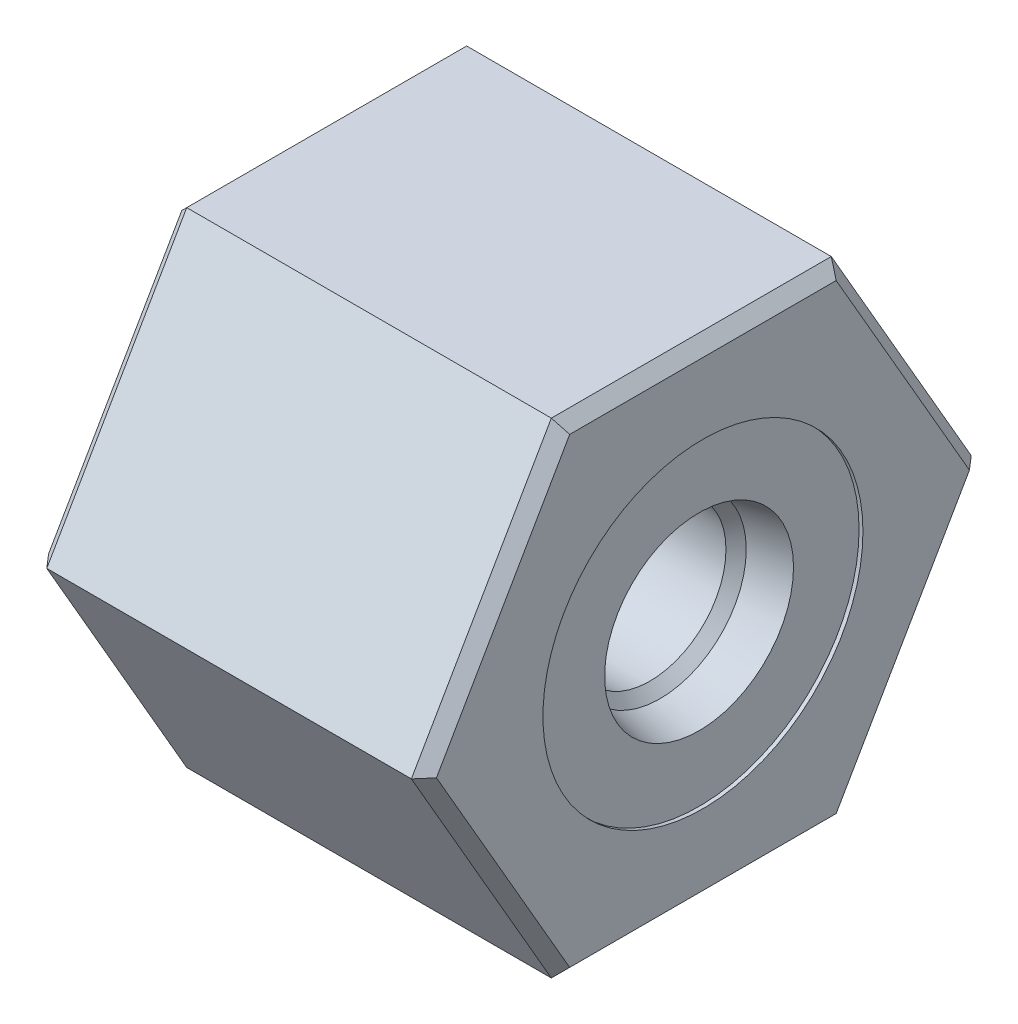
ISO-10303-21;
HEADER;
FILE_DESCRIPTION(('STEP AP214'),'2;1');
FILE_NAME('part.step','',(''),(''),'','','');
FILE_SCHEMA(('AUTOMOTIVE_DESIGN { 1 0 10303 214 1 1 1 1 }'));
ENDSEC;
DATA;
#1=APPLICATION_CONTEXT('core data for automotive mechanical design processes');
#2=APPLICATION_PROTOCOL_DEFINITION('international standard','automotive_design',2000,#1);
#3=PRODUCT_CONTEXT('',#1,'mechanical');
#4=PRODUCT('Part','Part','',(#3));
#5=PRODUCT_RELATED_PRODUCT_CATEGORY('part','',(#4));
#6=PRODUCT_DEFINITION_FORMATION('','',#4);
#7=PRODUCT_DEFINITION_CONTEXT('part definition',#1,'design');
#8=PRODUCT_DEFINITION('design','',#6,#7);
#9=PRODUCT_DEFINITION_SHAPE('','',#8);
#10=(LENGTH_UNIT() NAMED_UNIT(*) SI_UNIT(.MILLI.,.METRE.));
#11=(NAMED_UNIT(*) PLANE_ANGLE_UNIT() SI_UNIT($,.RADIAN.));
#12=(NAMED_UNIT(*) SI_UNIT($,.STERADIAN.) SOLID_ANGLE_UNIT());
#13=UNCERTAINTY_MEASURE_WITH_UNIT(LENGTH_MEASURE(1.E-05),#10,'distance_accuracy_value','');
#14=(GEOMETRIC_REPRESENTATION_CONTEXT(3) GLOBAL_UNCERTAINTY_ASSIGNED_CONTEXT((#13)) GLOBAL_UNIT_ASSIGNED_CONTEXT((#10,
#11,#12)) REPRESENTATION_CONTEXT('',''));
#15=CARTESIAN_POINT('',(0.,0.,0.));
#16=DIRECTION('',(0.,0.,1.));
#17=DIRECTION('',(1.,0.,0.));
#18=AXIS2_PLACEMENT_3D('',#15,#16,#17);
#19=CARTESIAN_POINT('',(25.4,-15.875,-9.16543552338531));
#20=DIRECTION('',(0.,-1.,0.));
#21=DIRECTION('',(0.,0.,-1.));
#22=AXIS2_PLACEMENT_3D('',#19,#20,#21);
#23=PLANE('',#22);
#24=DIRECTION('',(-1.,0.,0.));
#25=VECTOR('',#24,1.);
#26=CARTESIAN_POINT('',(25.4,-15.875,-9.16543552338531));
#27=LINE('',#26,#25);
#28=CARTESIAN_POINT('',(24.638,-15.875,-9.16543552338531));
#29=VERTEX_POINT('',#28);
#30=CARTESIAN_POINT('',(0.762000000000006,-15.875,-9.16543552338531));
#31=VERTEX_POINT('',#30);
#32=EDGE_CURVE('E261',#29,#31,#27,.T.);
#33=ORIENTED_EDGE('',*,*,#32,.F.);
#34=DIRECTION('',(0.,0.,1.));
#35=VECTOR('',#34,1.);
#36=CARTESIAN_POINT('',(24.638,-15.875,9.1654355233853));
#37=LINE('',#36,#35);
#38=CARTESIAN_POINT('',(24.638,-15.875,9.1654355233853));
#39=VERTEX_POINT('',#38);
#40=EDGE_CURVE('E42',#29,#39,#37,.T.);
#41=ORIENTED_EDGE('',*,*,#40,.T.);
#42=DIRECTION('',(-1.,0.,0.));
#43=VECTOR('',#42,1.);
#44=CARTESIAN_POINT('',(25.4,-15.875,9.1654355233853));
#45=LINE('',#44,#43);
#46=CARTESIAN_POINT('',(0.762000000000006,-15.875,9.1654355233853));
#47=VERTEX_POINT('',#46);
#48=EDGE_CURVE('E237',#39,#47,#45,.T.);
#49=ORIENTED_EDGE('',*,*,#48,.T.);
#50=DIRECTION('',(0.,0.,-1.));
#51=VECTOR('',#50,1.);
#52=CARTESIAN_POINT('',(0.761999999999999,-15.875,-9.16543552338531));
#53=LINE('',#52,#51);
#54=EDGE_CURVE('E150',#47,#31,#53,.T.);
#55=ORIENTED_EDGE('',*,*,#54,.T.);
#56=EDGE_LOOP('',(#33,#41,#49,#55));
#57=FACE_BOUND('',#56,.T.);
#58=ADVANCED_FACE('F33',(#57),#23,.T.);
#59=CARTESIAN_POINT('',(25.4,0.,-18.3308710467706));
#60=DIRECTION('',(0.,-0.5,-0.866025403784439));
#61=DIRECTION('',(0.,0.866025403784439,-0.5));
#62=AXIS2_PLACEMENT_3D('',#59,#60,#61);
#63=PLANE('',#62);
#64=DIRECTION('',(-1.,0.,0.));
#65=VECTOR('',#64,1.);
#66=CARTESIAN_POINT('',(25.4,0.,-18.3308710467706));
#67=LINE('',#66,#65);
#68=CARTESIAN_POINT('',(24.638,0.,-18.3308710467706));
#69=VERTEX_POINT('',#68);
#70=CARTESIAN_POINT('',(0.762000000000006,0.,-18.3308710467706));
#71=VERTEX_POINT('',#70);
#72=EDGE_CURVE('E259',#69,#71,#67,.T.);
#73=ORIENTED_EDGE('',*,*,#72,.F.);
#74=DIRECTION('',(0.,-0.866025403784439,0.5));
#75=VECTOR('',#74,1.);
#76=CARTESIAN_POINT('',(24.638,-15.875,-9.16543552338531));
#77=LINE('',#76,#75);
#78=EDGE_CURVE('E179',#69,#29,#77,.T.);
#79=ORIENTED_EDGE('',*,*,#78,.T.);
#80=ORIENTED_EDGE('',*,*,#32,.T.);
#81=DIRECTION('',(0.,0.866025403784439,-0.5));
#82=VECTOR('',#81,1.);
#83=CARTESIAN_POINT('',(0.761999999999999,0.,-18.3308710467706));
#84=LINE('',#83,#82);
#85=EDGE_CURVE('E218',#31,#71,#84,.T.);
#86=ORIENTED_EDGE('',*,*,#85,.T.);
#87=EDGE_LOOP('',(#73,#79,#80,#86));
#88=FACE_BOUND('',#87,.T.);
#89=ADVANCED_FACE('F338',(#88),#63,.T.);
#90=CARTESIAN_POINT('',(25.4,15.875,-9.16543552338532));
#91=DIRECTION('',(0.,0.5,-0.866025403784439));
#92=DIRECTION('',(0.,0.866025403784439,0.5));
#93=AXIS2_PLACEMENT_3D('',#90,#91,#92);
#94=PLANE('',#93);
#95=DIRECTION('',(-1.,0.,0.));
#96=VECTOR('',#95,1.);
#97=CARTESIAN_POINT('',(25.4,15.875,-9.16543552338532));
#98=LINE('',#97,#96);
#99=CARTESIAN_POINT('',(24.638,15.875,-9.16543552338532));
#100=VERTEX_POINT('',#99);
#101=CARTESIAN_POINT('',(0.762000000000002,15.875,-9.16543552338532));
#102=VERTEX_POINT('',#101);
#103=EDGE_CURVE('E257',#100,#102,#98,.T.);
#104=ORIENTED_EDGE('',*,*,#103,.F.);
#105=DIRECTION('',(0.,-0.866025403784439,-0.5));
#106=VECTOR('',#105,1.);
#107=CARTESIAN_POINT('',(24.638,0.,-18.3308710467706));
#108=LINE('',#107,#106);
#109=EDGE_CURVE('E160',#100,#69,#108,.T.);
#110=ORIENTED_EDGE('',*,*,#109,.T.);
#111=ORIENTED_EDGE('',*,*,#72,.T.);
#112=DIRECTION('',(0.,0.866025403784439,0.5));
#113=VECTOR('',#112,1.);
#114=CARTESIAN_POINT('',(0.761999999999999,15.875,-9.16543552338532));
#115=LINE('',#114,#113);
#116=EDGE_CURVE('E222',#71,#102,#115,.T.);
#117=ORIENTED_EDGE('',*,*,#116,.T.);
#118=EDGE_LOOP('',(#104,#110,#111,#117));
#119=FACE_BOUND('',#118,.T.);
#120=ADVANCED_FACE('F256',(#119),#94,.T.);
#121=CARTESIAN_POINT('',(25.4,15.875,9.16543552338532));
#122=DIRECTION('',(0.,1.,0.));
#123=DIRECTION('',(0.,0.,1.));
#124=AXIS2_PLACEMENT_3D('',#121,#122,#123);
#125=PLANE('',#124);
#126=DIRECTION('',(-1.,0.,0.));
#127=VECTOR('',#126,1.);
#128=CARTESIAN_POINT('',(25.4,15.875,9.16543552338532));
#129=LINE('',#128,#127);
#130=CARTESIAN_POINT('',(24.638,15.875,9.16543552338532));
#131=VERTEX_POINT('',#130);
#132=CARTESIAN_POINT('',(0.762000000000002,15.875,9.16543552338532));
#133=VERTEX_POINT('',#132);
#134=EDGE_CURVE('E265',#131,#133,#129,.T.);
#135=ORIENTED_EDGE('',*,*,#134,.F.);
#136=DIRECTION('',(0.,0.,-1.));
#137=VECTOR('',#136,1.);
#138=CARTESIAN_POINT('',(24.638,15.875,-9.16543552338532));
#139=LINE('',#138,#137);
#140=EDGE_CURVE('E177',#131,#100,#139,.T.);
#141=ORIENTED_EDGE('',*,*,#140,.T.);
#142=ORIENTED_EDGE('',*,*,#103,.T.);
#143=DIRECTION('',(0.,0.,1.));
#144=VECTOR('',#143,1.);
#145=CARTESIAN_POINT('',(0.761999999999999,15.875,9.16543552338532));
#146=LINE('',#145,#144);
#147=EDGE_CURVE('E221',#102,#133,#146,.T.);
#148=ORIENTED_EDGE('',*,*,#147,.T.);
#149=EDGE_LOOP('',(#135,#141,#142,#148));
#150=FACE_BOUND('',#149,.T.);
#151=ADVANCED_FACE('F391',(#150),#125,.T.);
#152=CARTESIAN_POINT('',(25.4,0.,18.3308710467706));
#153=DIRECTION('',(0.,0.5,0.866025403784439));
#154=DIRECTION('',(0.,-0.866025403784439,0.5));
#155=AXIS2_PLACEMENT_3D('',#152,#153,#154);
#156=PLANE('',#155);
#157=DIRECTION('',(-1.,0.,0.));
#158=VECTOR('',#157,1.);
#159=CARTESIAN_POINT('',(25.4,0.,18.3308710467706));
#160=LINE('',#159,#158);
#161=CARTESIAN_POINT('',(24.638,0.,18.3308710467706));
#162=VERTEX_POINT('',#161);
#163=CARTESIAN_POINT('',(0.762000000000002,0.,18.3308710467706));
#164=VERTEX_POINT('',#163);
#165=EDGE_CURVE('E238',#162,#164,#160,.T.);
#166=ORIENTED_EDGE('',*,*,#165,.F.);
#167=DIRECTION('',(0.,0.866025403784439,-0.5));
#168=VECTOR('',#167,1.);
#169=CARTESIAN_POINT('',(24.638,15.875,9.16543552338532));
#170=LINE('',#169,#168);
#171=EDGE_CURVE('E181',#162,#131,#170,.T.);
#172=ORIENTED_EDGE('',*,*,#171,.T.);
#173=ORIENTED_EDGE('',*,*,#134,.T.);
#174=DIRECTION('',(0.,-0.866025403784439,0.5));
#175=VECTOR('',#174,1.);
#176=CARTESIAN_POINT('',(0.761999999999999,0.,18.3308710467706));
#177=LINE('',#176,#175);
#178=EDGE_CURVE('E231',#133,#164,#177,.T.);
#179=ORIENTED_EDGE('',*,*,#178,.T.);
#180=EDGE_LOOP('',(#166,#172,#173,#179));
#181=FACE_BOUND('',#180,.T.);
#182=ADVANCED_FACE('F334',(#181),#156,.T.);
#183=CARTESIAN_POINT('',(25.4,-15.875,9.1654355233853));
#184=DIRECTION('',(0.,-0.5,0.866025403784439));
#185=DIRECTION('',(0.,-0.866025403784439,-0.5));
#186=AXIS2_PLACEMENT_3D('',#183,#184,#185);
#187=PLANE('',#186);
#188=ORIENTED_EDGE('',*,*,#48,.F.);
#189=DIRECTION('',(0.,0.866025403784439,0.5));
#190=VECTOR('',#189,1.);
#191=CARTESIAN_POINT('',(24.638,0.,18.3308710467706));
#192=LINE('',#191,#190);
#193=EDGE_CURVE('E11',#39,#162,#192,.T.);
#194=ORIENTED_EDGE('',*,*,#193,.T.);
#195=ORIENTED_EDGE('',*,*,#165,.T.);
#196=DIRECTION('',(0.,-0.866025403784439,-0.5));
#197=VECTOR('',#196,1.);
#198=CARTESIAN_POINT('',(0.761999999999999,-15.875,9.1654355233853));
#199=LINE('',#198,#197);
#200=EDGE_CURVE('E164',#164,#47,#199,.T.);
#201=ORIENTED_EDGE('',*,*,#200,.T.);
#202=EDGE_LOOP('',(#188,#194,#195,#201));
#203=FACE_BOUND('',#202,.T.);
#204=ADVANCED_FACE('F236',(#203),#187,.T.);
#205=CARTESIAN_POINT('',(25.4,-15.875,27.4963065701559));
#206=DIRECTION('',(-1.,0.,0.));
#207=DIRECTION('',(0.,0.,1.));
#208=AXIS2_PLACEMENT_3D('',#205,#206,#207);
#209=PLANE('',#208);
#210=DIRECTION('',(0.,0.866025403784439,-0.5));
#211=VECTOR('',#210,1.);
#212=CARTESIAN_POINT('',(25.4,0.380999999999999,-17.6709596890869));
#213=LINE('',#212,#211);
#214=CARTESIAN_POINT('',(25.4,-15.113,-8.72549461826282));
#215=VERTEX_POINT('',#214);
#216=CARTESIAN_POINT('',(25.4,0.,-17.4509892365256));
#217=VERTEX_POINT('',#216);
#218=EDGE_CURVE('E170',#215,#217,#213,.T.);
#219=ORIENTED_EDGE('',*,*,#218,.T.);
#220=DIRECTION('',(0.,0.866025403784439,0.5));
#221=VECTOR('',#220,1.);
#222=CARTESIAN_POINT('',(25.4,15.494,-8.50552416570158));
#223=LINE('',#222,#221);
#224=CARTESIAN_POINT('',(25.4,15.113,-8.72549461826283));
#225=VERTEX_POINT('',#224);
#226=EDGE_CURVE('E174',#217,#225,#223,.T.);
#227=ORIENTED_EDGE('',*,*,#226,.T.);
#228=DIRECTION('',(0.,0.,1.));
#229=VECTOR('',#228,1.);
#230=CARTESIAN_POINT('',(25.4,15.113,9.16543552338532));
#231=LINE('',#230,#229);
#232=CARTESIAN_POINT('',(25.4,15.113,8.72549461826283));
#233=VERTEX_POINT('',#232);
#234=EDGE_CURVE('E172',#225,#233,#231,.T.);
#235=ORIENTED_EDGE('',*,*,#234,.T.);
#236=DIRECTION('',(0.,-0.866025403784439,0.5));
#237=VECTOR('',#236,1.);
#238=CARTESIAN_POINT('',(25.4,-0.380999999999989,17.6709596890869));
#239=LINE('',#238,#237);
#240=CARTESIAN_POINT('',(25.4,0.,17.4509892365256));
#241=VERTEX_POINT('',#240);
#242=EDGE_CURVE('E168',#233,#241,#239,.T.);
#243=ORIENTED_EDGE('',*,*,#242,.T.);
#244=DIRECTION('',(0.,-0.866025403784439,-0.5));
#245=VECTOR('',#244,1.);
#246=CARTESIAN_POINT('',(25.4,-15.494,8.50552416570156));
#247=LINE('',#246,#245);
#248=CARTESIAN_POINT('',(25.4,-15.113,8.72549461826281));
#249=VERTEX_POINT('',#248);
#250=EDGE_CURVE('E163',#241,#249,#247,.T.);
#251=ORIENTED_EDGE('',*,*,#250,.T.);
#252=DIRECTION('',(0.,0.,-1.));
#253=VECTOR('',#252,1.);
#254=CARTESIAN_POINT('',(25.4,-15.113,-9.16543552338531));
#255=LINE('',#254,#253);
#256=EDGE_CURVE('E166',#249,#215,#255,.T.);
#257=ORIENTED_EDGE('',*,*,#256,.T.);
#258=EDGE_LOOP('',(#219,#227,#235,#243,#251,#257));
#259=FACE_BOUND('',#258,.T.);
#260=CARTESIAN_POINT('',(25.4,0.,0.));
#261=DIRECTION('',(1.,0.,0.));
#262=DIRECTION('',(0.,0.,-1.));
#263=AXIS2_PLACEMENT_3D('',#260,#261,#262);
#264=CIRCLE('',#263,10.4774999999901);
#265=CARTESIAN_POINT('',(25.4,0.,-10.4774999999901));
#266=VERTEX_POINT('',#265);
#267=EDGE_CURVE('E272',#266,#266,#264,.T.);
#268=ORIENTED_EDGE('',*,*,#267,.F.);
#269=EDGE_LOOP('',(#268));
#270=FACE_BOUND('',#269,.T.);
#271=ADVANCED_FACE('F324',(#259,#270),#209,.F.);
#272=CARTESIAN_POINT('',(0.,-15.875,27.4963065701559));
#273=DIRECTION('',(-1.,0.,0.));
#274=DIRECTION('',(0.,0.,1.));
#275=AXIS2_PLACEMENT_3D('',#272,#273,#274);
#276=PLANE('',#275);
#277=DIRECTION('',(0.,0.,-1.));
#278=VECTOR('',#277,1.);
#279=CARTESIAN_POINT('',(0.,15.113,27.4963065701559));
#280=LINE('',#279,#278);
#281=CARTESIAN_POINT('',(0.,15.113,8.72549461826283));
#282=VERTEX_POINT('',#281);
#283=CARTESIAN_POINT('',(0.,15.113,-8.72549461826282));
#284=VERTEX_POINT('',#283);
#285=EDGE_CURVE('E134',#282,#284,#280,.T.);
#286=ORIENTED_EDGE('',*,*,#285,.T.);
#287=DIRECTION('',(0.,-0.866025403784439,-0.5));
#288=VECTOR('',#287,1.);
#289=CARTESIAN_POINT('',(0.,7.55649999999998,-13.0882419273942));
#290=LINE('',#289,#288);
#291=CARTESIAN_POINT('',(0.,0.,-17.4509892365256));
#292=VERTEX_POINT('',#291);
#293=EDGE_CURVE('E227',#284,#292,#290,.T.);
#294=ORIENTED_EDGE('',*,*,#293,.T.);
#295=DIRECTION('',(0.,-0.866025403784439,0.5));
#296=VECTOR('',#295,1.);
#297=CARTESIAN_POINT('',(0.,-31.369,0.659911357683743));
#298=LINE('',#297,#296);
#299=CARTESIAN_POINT('',(0.,-15.113,-8.72549461826282));
#300=VERTEX_POINT('',#299);
#301=EDGE_CURVE('E129',#292,#300,#298,.T.);
#302=ORIENTED_EDGE('',*,*,#301,.T.);
#303=DIRECTION('',(0.,0.,1.));
#304=VECTOR('',#303,1.);
#305=CARTESIAN_POINT('',(0.,-15.113,27.4963065701559));
#306=LINE('',#305,#304);
#307=CARTESIAN_POINT('',(0.,-15.113,8.7254946182628));
#308=VERTEX_POINT('',#307);
#309=EDGE_CURVE('E121',#300,#308,#306,.T.);
#310=ORIENTED_EDGE('',*,*,#309,.T.);
#311=DIRECTION('',(0.,0.866025403784439,0.5));
#312=VECTOR('',#311,1.);
#313=CARTESIAN_POINT('',(0.,-7.5565,13.0882419273942));
#314=LINE('',#313,#312);
#315=CARTESIAN_POINT('',(0.,0.,17.4509892365256));
#316=VERTEX_POINT('',#315);
#317=EDGE_CURVE('E125',#308,#316,#314,.T.);
#318=ORIENTED_EDGE('',*,*,#317,.T.);
#319=DIRECTION('',(0.,0.866025403784439,-0.5));
#320=VECTOR('',#319,1.);
#321=CARTESIAN_POINT('',(0.,-16.256,26.8363952124722));
#322=LINE('',#321,#320);
#323=EDGE_CURVE('E135',#316,#282,#322,.T.);
#324=ORIENTED_EDGE('',*,*,#323,.T.);
#325=EDGE_LOOP('',(#286,#294,#302,#310,#318,#324));
#326=FACE_BOUND('',#325,.T.);
#327=CARTESIAN_POINT('',(0.,0.,0.));
#328=DIRECTION('',(-1.,0.,0.));
#329=DIRECTION('',(0.,0.,1.));
#330=AXIS2_PLACEMENT_3D('',#327,#328,#329);
#331=CIRCLE('',#330,12.1411999999999);
#332=CARTESIAN_POINT('',(0.,0.,12.1411999999999));
#333=VERTEX_POINT('',#332);
#334=EDGE_CURVE('E263',#333,#333,#331,.F.);
#335=ORIENTED_EDGE('',*,*,#334,.T.);
#336=EDGE_LOOP('',(#335));
#337=FACE_BOUND('',#336,.T.);
#338=ADVANCED_FACE('F123',(#326,#337),#276,.T.);
#339=CARTESIAN_POINT('',(0.,0.,0.));
#340=DIRECTION('',(1.,0.,0.));
#341=DIRECTION('',(0.,0.,-1.));
#342=AXIS2_PLACEMENT_3D('',#339,#340,#341);
#343=CYLINDRICAL_SURFACE('',#342,11.8872);
#344=CARTESIAN_POINT('',(0.253999999999938,0.,0.));
#345=DIRECTION('',(-1.,0.,0.));
#346=DIRECTION('',(0.,0.,1.));
#347=AXIS2_PLACEMENT_3D('',#344,#345,#346);
#348=CIRCLE('',#347,11.8872);
#349=CARTESIAN_POINT('',(0.253999999999938,0.,11.8872));
#350=VERTEX_POINT('',#349);
#351=EDGE_CURVE('E275',#350,#350,#348,.T.);
#352=ORIENTED_EDGE('',*,*,#351,.T.);
#353=EDGE_LOOP('',(#352));
#354=FACE_BOUND('',#353,.T.);
#355=CARTESIAN_POINT('',(9.78518859409031,0.,0.));
#356=DIRECTION('',(1.,0.,0.));
#357=DIRECTION('',(0.,0.,-1.));
#358=AXIS2_PLACEMENT_3D('',#355,#356,#357);
#359=CIRCLE('',#358,11.8872);
#360=CARTESIAN_POINT('',(9.78518859409031,0.,-11.8872));
#361=VERTEX_POINT('',#360);
#362=EDGE_CURVE('E153',#361,#361,#359,.T.);
#363=ORIENTED_EDGE('',*,*,#362,.T.);
#364=EDGE_LOOP('',(#363));
#365=FACE_BOUND('',#364,.T.);
#366=ADVANCED_FACE('F332',(#354,#365),#343,.F.);
#367=CARTESIAN_POINT('',(0.,0.,0.));
#368=DIRECTION('',(1.,0.,0.));
#369=DIRECTION('',(0.,0.,-1.));
#370=AXIS2_PLACEMENT_3D('',#367,#368,#369);
#371=CYLINDRICAL_SURFACE('',#370,10.4774999999901);
#372=CARTESIAN_POINT('',(25.1460000000165,0.,0.));
#373=DIRECTION('',(1.,0.,0.));
#374=DIRECTION('',(0.,0.,-1.));
#375=AXIS2_PLACEMENT_3D('',#372,#373,#374);
#376=CIRCLE('',#375,10.4774999999901);
#377=CARTESIAN_POINT('',(25.1460000000165,0.,-10.4774999999901));
#378=VERTEX_POINT('',#377);
#379=EDGE_CURVE('E317',#378,#378,#376,.T.);
#380=ORIENTED_EDGE('',*,*,#379,.F.);
#381=EDGE_LOOP('',(#380));
#382=FACE_BOUND('',#381,.T.);
#383=ORIENTED_EDGE('',*,*,#267,.T.);
#384=EDGE_LOOP('',(#383));
#385=FACE_BOUND('',#384,.T.);
#386=ADVANCED_FACE('F322',(#382,#385),#371,.F.);
#387=CARTESIAN_POINT('',(25.1460000000165,10.4774999999901,0.));
#388=DIRECTION('',(-1.,0.,0.));
#389=DIRECTION('',(0.,0.,1.));
#390=AXIS2_PLACEMENT_3D('',#387,#388,#389);
#391=PLANE('',#390);
#392=CARTESIAN_POINT('',(25.1460000000165,0.,0.));
#393=DIRECTION('',(1.,0.,0.));
#394=DIRECTION('',(0.,0.,-1.));
#395=AXIS2_PLACEMENT_3D('',#392,#393,#394);
#396=CIRCLE('',#395,6.18489999999385);
#397=CARTESIAN_POINT('',(25.1460000000165,0.,-6.18489999999385));
#398=VERTEX_POINT('',#397);
#399=EDGE_CURVE('E314',#398,#398,#396,.T.);
#400=ORIENTED_EDGE('',*,*,#399,.F.);
#401=EDGE_LOOP('',(#400));
#402=FACE_BOUND('',#401,.T.);
#403=ORIENTED_EDGE('',*,*,#379,.T.);
#404=EDGE_LOOP('',(#403));
#405=FACE_BOUND('',#404,.T.);
#406=ADVANCED_FACE('F544',(#402,#405),#391,.F.);
#407=CARTESIAN_POINT('',(25.1460000000165,0.,0.));
#408=DIRECTION('',(1.,0.,0.));
#409=DIRECTION('',(0.,0.,-1.));
#410=AXIS2_PLACEMENT_3D('',#407,#408,#409);
#411=CONICAL_SURFACE('',#410,6.18489999999385,0.209439510237865);
#412=CARTESIAN_POINT('',(22.5932999999927,0.,0.));
#413=DIRECTION('',(1.,0.,0.));
#414=DIRECTION('',(0.,0.,-1.));
#415=AXIS2_PLACEMENT_3D('',#412,#413,#414);
#416=CIRCLE('',#415,5.6423068650176);
#417=CARTESIAN_POINT('',(22.5932999999927,0.,-5.6423068650176));
#418=VERTEX_POINT('',#417);
#419=EDGE_CURVE('E306',#418,#418,#416,.T.);
#420=ORIENTED_EDGE('',*,*,#419,.F.);
#421=EDGE_LOOP('',(#420));
#422=FACE_BOUND('',#421,.T.);
#423=ORIENTED_EDGE('',*,*,#399,.T.);
#424=EDGE_LOOP('',(#423));
#425=FACE_BOUND('',#424,.T.);
#426=ADVANCED_FACE('F535',(#422,#425),#411,.F.);
#427=CARTESIAN_POINT('',(22.5932999999927,0.,0.));
#428=DIRECTION('',(1.,0.,0.));
#429=DIRECTION('',(0.,0.,-1.));
#430=AXIS2_PLACEMENT_3D('',#427,#428,#429);
#431=CONICAL_SURFACE('',#430,5.6423068650176,0.78539816339745);
#432=CARTESIAN_POINT('',(21.9293931349751,0.,0.));
#433=DIRECTION('',(1.,0.,0.));
#434=DIRECTION('',(0.,0.,-1.));
#435=AXIS2_PLACEMENT_3D('',#432,#433,#434);
#436=CIRCLE('',#435,4.9784);
#437=CARTESIAN_POINT('',(21.9293931349751,0.,-4.9784));
#438=VERTEX_POINT('',#437);
#439=EDGE_CURVE('E302',#438,#438,#436,.T.);
#440=ORIENTED_EDGE('',*,*,#439,.F.);
#441=EDGE_LOOP('',(#440));
#442=FACE_BOUND('',#441,.T.);
#443=ORIENTED_EDGE('',*,*,#419,.T.);
#444=EDGE_LOOP('',(#443));
#445=FACE_BOUND('',#444,.T.);
#446=ADVANCED_FACE('F528',(#442,#445),#431,.F.);
#447=CARTESIAN_POINT('',(0.,0.,0.));
#448=DIRECTION('',(1.,0.,0.));
#449=DIRECTION('',(0.,0.,-1.));
#450=AXIS2_PLACEMENT_3D('',#447,#448,#449);
#451=CYLINDRICAL_SURFACE('',#450,4.9784);
#452=CARTESIAN_POINT('',(14.224,0.,0.));
#453=DIRECTION('',(1.,0.,0.));
#454=DIRECTION('',(0.,0.,-1.));
#455=AXIS2_PLACEMENT_3D('',#452,#453,#454);
#456=CIRCLE('',#455,4.9784);
#457=CARTESIAN_POINT('',(14.224,0.,-4.9784));
#458=VERTEX_POINT('',#457);
#459=EDGE_CURVE('E146',#458,#458,#456,.F.);
#460=ORIENTED_EDGE('',*,*,#459,.T.);
#461=EDGE_LOOP('',(#460));
#462=FACE_BOUND('',#461,.T.);
#463=ORIENTED_EDGE('',*,*,#439,.T.);
#464=EDGE_LOOP('',(#463));
#465=FACE_BOUND('',#464,.T.);
#466=ADVANCED_FACE('F283',(#462,#465),#451,.F.);
#467=CARTESIAN_POINT('',(13.462,4.9784,0.));
#468=DIRECTION('',(1.,0.,0.));
#469=DIRECTION('',(0.,0.,-1.));
#470=AXIS2_PLACEMENT_3D('',#467,#468,#469);
#471=PLANE('',#470);
#472=CARTESIAN_POINT('',(13.462,0.,0.));
#473=DIRECTION('',(1.,0.,0.));
#474=DIRECTION('',(0.,0.,-1.));
#475=AXIS2_PLACEMENT_3D('',#472,#473,#474);
#476=CIRCLE('',#475,5.74039999999999);
#477=CARTESIAN_POINT('',(13.462,0.,-5.74039999999999));
#478=VERTEX_POINT('',#477);
#479=EDGE_CURVE('E278',#478,#478,#476,.T.);
#480=ORIENTED_EDGE('',*,*,#479,.T.);
#481=EDGE_LOOP('',(#480));
#482=FACE_BOUND('',#481,.T.);
#483=CARTESIAN_POINT('',(13.462,0.,0.));
#484=DIRECTION('',(1.,0.,0.));
#485=DIRECTION('',(0.,0.,-1.));
#486=AXIS2_PLACEMENT_3D('',#483,#484,#485);
#487=CIRCLE('',#486,11.7221);
#488=CARTESIAN_POINT('',(13.462,0.,-11.7221));
#489=VERTEX_POINT('',#488);
#490=EDGE_CURVE('E300',#489,#489,#487,.T.);
#491=ORIENTED_EDGE('',*,*,#490,.F.);
#492=EDGE_LOOP('',(#491));
#493=FACE_BOUND('',#492,.T.);
#494=ADVANCED_FACE('F293',(#482,#493),#471,.F.);
#495=CARTESIAN_POINT('',(0.,0.,0.));
#496=DIRECTION('',(1.,0.,0.));
#497=DIRECTION('',(0.,0.,-1.));
#498=AXIS2_PLACEMENT_3D('',#495,#496,#497);
#499=CYLINDRICAL_SURFACE('',#498,11.7221);
#500=CARTESIAN_POINT('',(10.16,0.,0.));
#501=DIRECTION('',(1.,0.,0.));
#502=DIRECTION('',(0.,0.,-1.));
#503=AXIS2_PLACEMENT_3D('',#500,#501,#502);
#504=CIRCLE('',#503,11.7221);
#505=CARTESIAN_POINT('',(10.16,0.,-11.7221));
#506=VERTEX_POINT('',#505);
#507=EDGE_CURVE('E303',#506,#506,#504,.T.);
#508=ORIENTED_EDGE('',*,*,#507,.F.);
#509=EDGE_LOOP('',(#508));
#510=FACE_BOUND('',#509,.T.);
#511=ORIENTED_EDGE('',*,*,#490,.T.);
#512=EDGE_LOOP('',(#511));
#513=FACE_BOUND('',#512,.T.);
#514=ADVANCED_FACE('F296',(#510,#513),#499,.F.);
#515=CARTESIAN_POINT('',(9.78518859409031,0.,0.));
#516=DIRECTION('',(1.,0.,0.));
#517=DIRECTION('',(0.,0.,-1.));
#518=AXIS2_PLACEMENT_3D('',#515,#516,#517);
#519=TOROIDAL_SURFACE('',#518,11.3792,0.508);
#520=ORIENTED_EDGE('',*,*,#362,.F.);
#521=EDGE_LOOP('',(#520));
#522=FACE_BOUND('',#521,.T.);
#523=ORIENTED_EDGE('',*,*,#507,.T.);
#524=EDGE_LOOP('',(#523));
#525=FACE_BOUND('',#524,.T.);
#526=ADVANCED_FACE('F347',(#522,#525),#519,.F.);
#527=CARTESIAN_POINT('',(0.,0.,0.));
#528=DIRECTION('',(-1.,0.,0.));
#529=DIRECTION('',(0.,0.,1.));
#530=AXIS2_PLACEMENT_3D('',#527,#528,#529);
#531=CONICAL_SURFACE('',#530,12.1411999999999,0.785398163397458);
#532=ORIENTED_EDGE('',*,*,#351,.F.);
#533=EDGE_LOOP('',(#532));
#534=FACE_BOUND('',#533,.T.);
#535=ORIENTED_EDGE('',*,*,#334,.F.);
#536=EDGE_LOOP('',(#535));
#537=FACE_BOUND('',#536,.T.);
#538=ADVANCED_FACE('F289',(#534,#537),#531,.F.);
#539=CARTESIAN_POINT('',(13.462,0.,0.));
#540=DIRECTION('',(-1.,0.,0.));
#541=DIRECTION('',(0.,0.,1.));
#542=AXIS2_PLACEMENT_3D('',#539,#540,#541);
#543=CONICAL_SURFACE('',#542,5.74039999999999,0.785398163397452);
#544=ORIENTED_EDGE('',*,*,#459,.F.);
#545=EDGE_LOOP('',(#544));
#546=FACE_BOUND('',#545,.T.);
#547=ORIENTED_EDGE('',*,*,#479,.F.);
#548=EDGE_LOOP('',(#547));
#549=FACE_BOUND('',#548,.T.);
#550=ADVANCED_FACE('F286',(#546,#549),#543,.F.);
#551=CARTESIAN_POINT('',(0.,-7.5565,13.0882419273942));
#552=DIRECTION('',(0.707106781186549,0.353553390593273,-0.612372435695793));
#553=DIRECTION('',(-0.654653670707976,0.,-0.755928946018456));
#554=AXIS2_PLACEMENT_3D('',#551,#552,#553);
#555=PLANE('',#554);
#556=DIRECTION('',(0.654653670707975,-0.654653670707978,0.377964473009228));
#557=VECTOR('',#556,1.);
#558=CARTESIAN_POINT('',(-2.159,-12.954,7.4789953870824));
#559=LINE('',#558,#557);
#560=EDGE_CURVE('E141',#47,#308,#559,.F.);
#561=ORIENTED_EDGE('',*,*,#560,.F.);
#562=ORIENTED_EDGE('',*,*,#200,.F.);
#563=DIRECTION('',(-0.654653670707976,0.,-0.755928946018455));
#564=VECTOR('',#563,1.);
#565=CARTESIAN_POINT('',(-2.15899999999999,0.,14.9579907741648));
#566=LINE('',#565,#564);
#567=EDGE_CURVE('E144',#316,#164,#566,.F.);
#568=ORIENTED_EDGE('',*,*,#567,.F.);
#569=ORIENTED_EDGE('',*,*,#317,.F.);
#570=EDGE_LOOP('',(#561,#562,#568,#569));
#571=FACE_BOUND('',#570,.T.);
#572=ADVANCED_FACE('F139',(#571),#555,.F.);
#573=CARTESIAN_POINT('',(0.,-16.256,26.8363952124722));
#574=DIRECTION('',(0.707106781186548,-0.353553390593273,-0.612372435695794));
#575=DIRECTION('',(-0.654653670707977,0.,-0.755928946018455));
#576=AXIS2_PLACEMENT_3D('',#573,#574,#575);
#577=PLANE('',#576);
#578=ORIENTED_EDGE('',*,*,#567,.T.);
#579=ORIENTED_EDGE('',*,*,#178,.F.);
#580=DIRECTION('',(-0.654653670707976,-0.654653670707979,-0.377964473009226));
#581=VECTOR('',#580,1.);
#582=CARTESIAN_POINT('',(-8.96257142857147,6.15042857142848,3.55095159134585));
#583=LINE('',#582,#581);
#584=EDGE_CURVE('E151',#282,#133,#583,.F.);
#585=ORIENTED_EDGE('',*,*,#584,.F.);
#586=ORIENTED_EDGE('',*,*,#323,.F.);
#587=EDGE_LOOP('',(#578,#579,#585,#586));
#588=FACE_BOUND('',#587,.T.);
#589=ADVANCED_FACE('F240',(#588),#577,.F.);
#590=CARTESIAN_POINT('',(0.,-15.113,27.4963065701559));
#591=DIRECTION('',(0.707106781186549,0.707106781186546,0.));
#592=DIRECTION('',(-0.707106781186546,0.707106781186549,0.));
#593=AXIS2_PLACEMENT_3D('',#590,#591,#592);
#594=PLANE('',#593);
#595=ORIENTED_EDGE('',*,*,#560,.T.);
#596=ORIENTED_EDGE('',*,*,#309,.F.);
#597=DIRECTION('',(0.654653670707976,-0.654653670707979,-0.377964473009225));
#598=VECTOR('',#597,1.);
#599=CARTESIAN_POINT('',(-8.96257142857136,-6.15042857142859,-3.55095159134592));
#600=LINE('',#599,#598);
#601=EDGE_CURVE('E156',#31,#300,#600,.F.);
#602=ORIENTED_EDGE('',*,*,#601,.F.);
#603=ORIENTED_EDGE('',*,*,#54,.F.);
#604=EDGE_LOOP('',(#595,#596,#602,#603));
#605=FACE_BOUND('',#604,.T.);
#606=ADVANCED_FACE('F148',(#605),#594,.F.);
#607=CARTESIAN_POINT('',(0.,15.113,27.4963065701559));
#608=DIRECTION('',(0.707106781186549,-0.707106781186546,0.));
#609=DIRECTION('',(0.707106781186546,0.707106781186549,0.));
#610=AXIS2_PLACEMENT_3D('',#607,#608,#609);
#611=PLANE('',#610);
#612=ORIENTED_EDGE('',*,*,#584,.T.);
#613=ORIENTED_EDGE('',*,*,#147,.F.);
#614=DIRECTION('',(-0.654653670707976,-0.654653670707979,0.377964473009227));
#615=VECTOR('',#614,1.);
#616=CARTESIAN_POINT('',(-8.96257142857141,6.15042857142854,-3.55095159134585));
#617=LINE('',#616,#615);
#618=EDGE_CURVE('E204',#284,#102,#617,.F.);
#619=ORIENTED_EDGE('',*,*,#618,.F.);
#620=ORIENTED_EDGE('',*,*,#285,.F.);
#621=EDGE_LOOP('',(#612,#613,#619,#620));
#622=FACE_BOUND('',#621,.T.);
#623=ADVANCED_FACE('F251',(#622),#611,.F.);
#624=CARTESIAN_POINT('',(0.,-31.369,0.659911357683743));
#625=DIRECTION('',(0.707106781186547,0.353553390593274,0.612372435695794));
#626=DIRECTION('',(0.654653670707977,0.,-0.755928946018454));
#627=AXIS2_PLACEMENT_3D('',#624,#625,#626);
#628=PLANE('',#627);
#629=ORIENTED_EDGE('',*,*,#601,.T.);
#630=ORIENTED_EDGE('',*,*,#301,.F.);
#631=DIRECTION('',(0.654653670707976,0.,-0.755928946018455));
#632=VECTOR('',#631,1.);
#633=CARTESIAN_POINT('',(-8.96257142857147,0.,-7.10190318269163));
#634=LINE('',#633,#632);
#635=EDGE_CURVE('E199',#71,#292,#634,.F.);
#636=ORIENTED_EDGE('',*,*,#635,.F.);
#637=ORIENTED_EDGE('',*,*,#85,.F.);
#638=EDGE_LOOP('',(#629,#630,#636,#637));
#639=FACE_BOUND('',#638,.T.);
#640=ADVANCED_FACE('F216',(#639),#628,.F.);
#641=CARTESIAN_POINT('',(0.,7.55649999999999,-13.0882419273942));
#642=DIRECTION('',(0.707106781186549,-0.353553390593273,0.612372435695794));
#643=DIRECTION('',(0.654653670707976,0.,-0.755928946018456));
#644=AXIS2_PLACEMENT_3D('',#641,#642,#643);
#645=PLANE('',#644);
#646=ORIENTED_EDGE('',*,*,#618,.T.);
#647=ORIENTED_EDGE('',*,*,#116,.F.);
#648=ORIENTED_EDGE('',*,*,#635,.T.);
#649=ORIENTED_EDGE('',*,*,#293,.F.);
#650=EDGE_LOOP('',(#646,#647,#648,#649));
#651=FACE_BOUND('',#650,.T.);
#652=ADVANCED_FACE('F248',(#651),#645,.F.);
#653=CARTESIAN_POINT('',(24.638,-15.875,9.1654355233853));
#654=DIRECTION('',(0.707106781186547,-0.353553390593274,0.612372435695795));
#655=DIRECTION('',(0.654653670707977,0.,-0.755928946018454));
#656=AXIS2_PLACEMENT_3D('',#653,#654,#655);
#657=PLANE('',#656);
#658=DIRECTION('',(0.654653670707977,0.654653670707978,-0.377964473009226));
#659=VECTOR('',#658,1.);
#660=CARTESIAN_POINT('',(24.638,-15.875,9.1654355233853));
#661=LINE('',#660,#659);
#662=EDGE_CURVE('E193',#249,#39,#661,.F.);
#663=ORIENTED_EDGE('',*,*,#662,.F.);
#664=ORIENTED_EDGE('',*,*,#250,.F.);
#665=DIRECTION('',(-0.654653670707977,0.,0.755928946018455));
#666=VECTOR('',#665,1.);
#667=CARTESIAN_POINT('',(29.1737142857143,0.,13.0934793191219));
#668=LINE('',#667,#666);
#669=EDGE_CURVE('E37',#162,#241,#668,.F.);
#670=ORIENTED_EDGE('',*,*,#669,.F.);
#671=ORIENTED_EDGE('',*,*,#193,.F.);
#672=EDGE_LOOP('',(#663,#664,#670,#671));
#673=FACE_BOUND('',#672,.T.);
#674=ADVANCED_FACE('F35',(#673),#657,.T.);
#675=CARTESIAN_POINT('',(24.638,0.,18.3308710467706));
#676=DIRECTION('',(0.707106781186548,0.353553390593273,0.612372435695794));
#677=DIRECTION('',(0.654653670707977,0.,-0.755928946018455));
#678=AXIS2_PLACEMENT_3D('',#675,#676,#677);
#679=PLANE('',#678);
#680=ORIENTED_EDGE('',*,*,#669,.T.);
#681=ORIENTED_EDGE('',*,*,#242,.F.);
#682=DIRECTION('',(-0.654653670707976,0.654653670707979,0.377964473009226));
#683=VECTOR('',#682,1.);
#684=CARTESIAN_POINT('',(29.1737142857143,11.3392857142857,6.54673965956094));
#685=LINE('',#684,#683);
#686=EDGE_CURVE('E191',#131,#233,#685,.F.);
#687=ORIENTED_EDGE('',*,*,#686,.F.);
#688=ORIENTED_EDGE('',*,*,#171,.F.);
#689=EDGE_LOOP('',(#680,#681,#687,#688));
#690=FACE_BOUND('',#689,.T.);
#691=ADVANCED_FACE('F376',(#690),#679,.T.);
#692=CARTESIAN_POINT('',(24.638,-15.875,-9.16543552338531));
#693=DIRECTION('',(0.707106781186548,-0.707106781186547,0.));
#694=DIRECTION('',(0.707106781186547,0.707106781186548,0.));
#695=AXIS2_PLACEMENT_3D('',#692,#693,#694);
#696=PLANE('',#695);
#697=ORIENTED_EDGE('',*,*,#662,.T.);
#698=ORIENTED_EDGE('',*,*,#40,.F.);
#699=DIRECTION('',(0.654653670707977,0.654653670707978,0.377964473009226));
#700=VECTOR('',#699,1.);
#701=CARTESIAN_POINT('',(24.638,-15.875,-9.16543552338531));
#702=LINE('',#701,#700);
#703=EDGE_CURVE('E188',#215,#29,#702,.F.);
#704=ORIENTED_EDGE('',*,*,#703,.F.);
#705=ORIENTED_EDGE('',*,*,#256,.F.);
#706=EDGE_LOOP('',(#697,#698,#704,#705));
#707=FACE_BOUND('',#706,.T.);
#708=ADVANCED_FACE('F373',(#707),#696,.T.);
#709=CARTESIAN_POINT('',(24.638,15.875,9.16543552338532));
#710=DIRECTION('',(0.707106781186549,0.707106781186546,0.));
#711=DIRECTION('',(-0.707106781186546,0.707106781186549,0.));
#712=AXIS2_PLACEMENT_3D('',#709,#710,#711);
#713=PLANE('',#712);
#714=ORIENTED_EDGE('',*,*,#686,.T.);
#715=ORIENTED_EDGE('',*,*,#234,.F.);
#716=DIRECTION('',(-0.654653670707977,0.65465367070798,-0.377964473009221));
#717=VECTOR('',#716,1.);
#718=CARTESIAN_POINT('',(29.1737142857142,11.3392857142858,-6.54673965956102));
#719=LINE('',#718,#717);
#720=EDGE_CURVE('E186',#100,#225,#719,.F.);
#721=ORIENTED_EDGE('',*,*,#720,.F.);
#722=ORIENTED_EDGE('',*,*,#140,.F.);
#723=EDGE_LOOP('',(#714,#715,#721,#722));
#724=FACE_BOUND('',#723,.T.);
#725=ADVANCED_FACE('F369',(#724),#713,.T.);
#726=CARTESIAN_POINT('',(24.638,0.,-18.3308710467706));
#727=DIRECTION('',(0.707106781186547,-0.353553390593274,-0.612372435695794));
#728=DIRECTION('',(-0.654653670707977,0.,-0.755928946018454));
#729=AXIS2_PLACEMENT_3D('',#726,#727,#728);
#730=PLANE('',#729);
#731=ORIENTED_EDGE('',*,*,#703,.T.);
#732=ORIENTED_EDGE('',*,*,#78,.F.);
#733=DIRECTION('',(0.654653670707978,0.,0.755928946018453));
#734=VECTOR('',#733,1.);
#735=CARTESIAN_POINT('',(24.638,0.,-18.3308710467706));
#736=LINE('',#735,#734);
#737=EDGE_CURVE('E184',#217,#69,#736,.F.);
#738=ORIENTED_EDGE('',*,*,#737,.F.);
#739=ORIENTED_EDGE('',*,*,#218,.F.);
#740=EDGE_LOOP('',(#731,#732,#738,#739));
#741=FACE_BOUND('',#740,.T.);
#742=ADVANCED_FACE('F365',(#741),#730,.T.);
#743=CARTESIAN_POINT('',(24.638,15.875,-9.16543552338532));
#744=DIRECTION('',(0.707106781186545,0.353553390593275,-0.612372435695797));
#745=DIRECTION('',(-0.65465367070798,0.,-0.755928946018452));
#746=AXIS2_PLACEMENT_3D('',#743,#744,#745);
#747=PLANE('',#746);
#748=ORIENTED_EDGE('',*,*,#720,.T.);
#749=ORIENTED_EDGE('',*,*,#226,.F.);
#750=ORIENTED_EDGE('',*,*,#737,.T.);
#751=ORIENTED_EDGE('',*,*,#109,.F.);
#752=EDGE_LOOP('',(#748,#749,#750,#751));
#753=FACE_BOUND('',#752,.T.);
#754=ADVANCED_FACE('F362',(#753),#747,.T.);
#755=CLOSED_SHELL('',(#58,#89,#120,#151,#182,#204,#271,#338,#366,#386,#406,#426,#446,#466,#494,
#514,#526,#538,#550,#572,#589,#606,#623,#640,#652,#674,#691,#708,#725,#742,#754));
#756=MANIFOLD_SOLID_BREP('B2',#755);
#757=ADVANCED_BREP_SHAPE_REPRESENTATION('',(#18,#756),#14);
#758=SHAPE_DEFINITION_REPRESENTATION(#9,#757);
ENDSEC;
END-ISO-10303-21;
